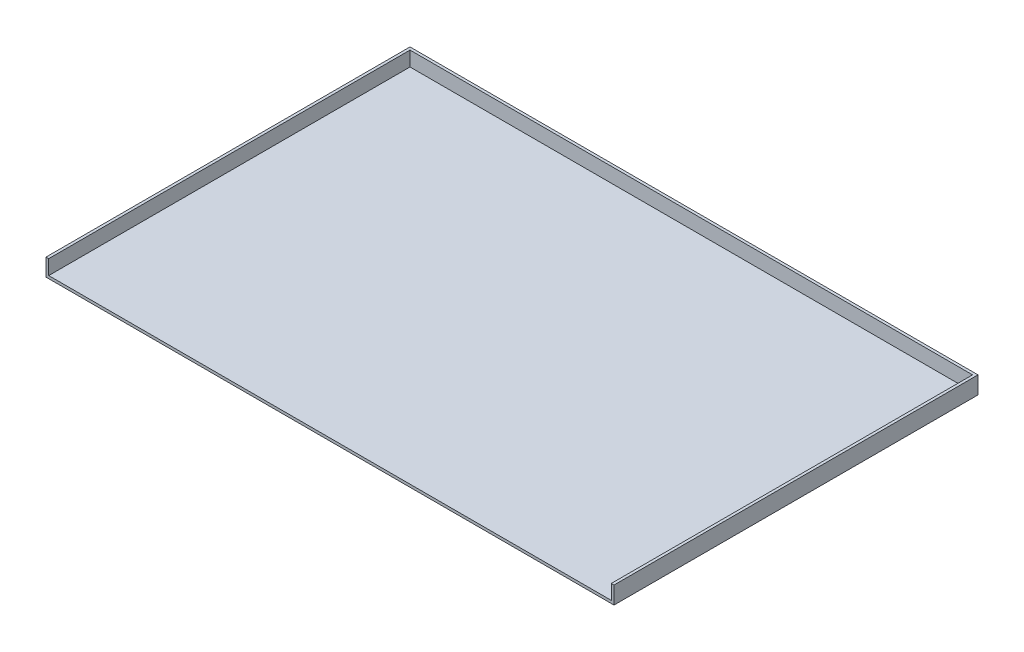
ISO-10303-21;
HEADER;
FILE_DESCRIPTION(('STEP AP214'),'2;1');
FILE_NAME('part.step','',(''),(''),'','','');
FILE_SCHEMA(('AUTOMOTIVE_DESIGN { 1 0 10303 214 1 1 1 1 }'));
ENDSEC;
DATA;
#1=APPLICATION_CONTEXT('core data for automotive mechanical design processes');
#2=APPLICATION_PROTOCOL_DEFINITION('international standard','automotive_design',2000,#1);
#3=PRODUCT_CONTEXT('',#1,'mechanical');
#4=PRODUCT('Part','Part','',(#3));
#5=PRODUCT_RELATED_PRODUCT_CATEGORY('part','',(#4));
#6=PRODUCT_DEFINITION_FORMATION('','',#4);
#7=PRODUCT_DEFINITION_CONTEXT('part definition',#1,'design');
#8=PRODUCT_DEFINITION('design','',#6,#7);
#9=PRODUCT_DEFINITION_SHAPE('','',#8);
#10=(LENGTH_UNIT() NAMED_UNIT(*) SI_UNIT(.MILLI.,.METRE.));
#11=(NAMED_UNIT(*) PLANE_ANGLE_UNIT() SI_UNIT($,.RADIAN.));
#12=(NAMED_UNIT(*) SI_UNIT($,.STERADIAN.) SOLID_ANGLE_UNIT());
#13=UNCERTAINTY_MEASURE_WITH_UNIT(LENGTH_MEASURE(1.E-05),#10,'distance_accuracy_value','');
#14=(GEOMETRIC_REPRESENTATION_CONTEXT(3) GLOBAL_UNCERTAINTY_ASSIGNED_CONTEXT((#13)) GLOBAL_UNIT_ASSIGNED_CONTEXT((#10,
#11,#12)) REPRESENTATION_CONTEXT('',''));
#15=CARTESIAN_POINT('',(0.,0.,0.));
#16=DIRECTION('',(0.,0.,1.));
#17=DIRECTION('',(1.,0.,0.));
#18=AXIS2_PLACEMENT_3D('',#15,#16,#17);
#19=CARTESIAN_POINT('',(-193.5,0.925,248.));
#20=DIRECTION('',(0.,-1.,0.));
#21=DIRECTION('',(0.,0.,-1.));
#22=AXIS2_PLACEMENT_3D('',#19,#20,#21);
#23=PLANE('',#22);
#24=DIRECTION('',(0.,0.,1.));
#25=VECTOR('',#24,1.);
#26=CARTESIAN_POINT('',(191.65,0.925,1.85000000000005));
#27=LINE('',#26,#25);
#28=CARTESIAN_POINT('',(191.65,0.925,1.85000000000005));
#29=VERTEX_POINT('',#28);
#30=CARTESIAN_POINT('',(191.65,0.925,248.));
#31=VERTEX_POINT('',#30);
#32=EDGE_CURVE('E50',#29,#31,#27,.T.);
#33=ORIENTED_EDGE('',*,*,#32,.F.);
#34=DIRECTION('',(1.,0.,0.));
#35=VECTOR('',#34,1.);
#36=CARTESIAN_POINT('',(-191.65,0.925,1.85000000000005));
#37=LINE('',#36,#35);
#38=CARTESIAN_POINT('',(-191.65,0.925,1.85000000000005));
#39=VERTEX_POINT('',#38);
#40=EDGE_CURVE('E127',#39,#29,#37,.T.);
#41=ORIENTED_EDGE('',*,*,#40,.F.);
#42=DIRECTION('',(0.,0.,-1.));
#43=VECTOR('',#42,1.);
#44=CARTESIAN_POINT('',(-191.65,0.925,248.));
#45=LINE('',#44,#43);
#46=CARTESIAN_POINT('',(-191.65,0.925,248.));
#47=VERTEX_POINT('',#46);
#48=EDGE_CURVE('E55',#47,#39,#45,.T.);
#49=ORIENTED_EDGE('',*,*,#48,.F.);
#50=DIRECTION('',(-1.,0.,0.));
#51=VECTOR('',#50,1.);
#52=CARTESIAN_POINT('',(-193.5,0.925,248.));
#53=LINE('',#52,#51);
#54=EDGE_CURVE('E110',#31,#47,#53,.T.);
#55=ORIENTED_EDGE('',*,*,#54,.F.);
#56=EDGE_LOOP('',(#33,#41,#49,#55));
#57=FACE_BOUND('',#56,.T.);
#58=ADVANCED_FACE('F35',(#57),#23,.F.);
#59=CARTESIAN_POINT('',(193.5,-0.925,248.));
#60=DIRECTION('',(-1.,0.,0.));
#61=DIRECTION('',(0.,0.,1.));
#62=AXIS2_PLACEMENT_3D('',#59,#60,#61);
#63=PLANE('',#62);
#64=DIRECTION('',(0.,1.,0.));
#65=VECTOR('',#64,1.);
#66=CARTESIAN_POINT('',(193.5,-0.925,0.));
#67=LINE('',#66,#65);
#68=CARTESIAN_POINT('',(193.5,-0.925,0.));
#69=VERTEX_POINT('',#68);
#70=CARTESIAN_POINT('',(193.5,10.925,0.));
#71=VERTEX_POINT('',#70);
#72=EDGE_CURVE('E116',#69,#71,#67,.T.);
#73=ORIENTED_EDGE('',*,*,#72,.T.);
#74=DIRECTION('',(0.,0.,-1.));
#75=VECTOR('',#74,1.);
#76=CARTESIAN_POINT('',(193.5,10.925,248.));
#77=LINE('',#76,#75);
#78=CARTESIAN_POINT('',(193.5,10.925,248.));
#79=VERTEX_POINT('',#78);
#80=EDGE_CURVE('E114',#79,#71,#77,.T.);
#81=ORIENTED_EDGE('',*,*,#80,.F.);
#82=DIRECTION('',(0.,1.,0.));
#83=VECTOR('',#82,1.);
#84=CARTESIAN_POINT('',(193.5,-0.925,248.));
#85=LINE('',#84,#83);
#86=CARTESIAN_POINT('',(193.5,-0.925,248.));
#87=VERTEX_POINT('',#86);
#88=EDGE_CURVE('E99',#87,#79,#85,.T.);
#89=ORIENTED_EDGE('',*,*,#88,.F.);
#90=DIRECTION('',(0.,0.,-1.));
#91=VECTOR('',#90,1.);
#92=CARTESIAN_POINT('',(193.5,-0.925,248.));
#93=LINE('',#92,#91);
#94=EDGE_CURVE('E43',#87,#69,#93,.T.);
#95=ORIENTED_EDGE('',*,*,#94,.T.);
#96=EDGE_LOOP('',(#73,#81,#89,#95));
#97=FACE_BOUND('',#96,.T.);
#98=ADVANCED_FACE('F37',(#97),#63,.F.);
#99=CARTESIAN_POINT('',(-193.5,-0.925,248.));
#100=DIRECTION('',(1.,0.,0.));
#101=DIRECTION('',(0.,0.,-1.));
#102=AXIS2_PLACEMENT_3D('',#99,#100,#101);
#103=PLANE('',#102);
#104=DIRECTION('',(0.,-1.,0.));
#105=VECTOR('',#104,1.);
#106=CARTESIAN_POINT('',(-193.5,-0.925,0.));
#107=LINE('',#106,#105);
#108=CARTESIAN_POINT('',(-193.5,10.925,0.));
#109=VERTEX_POINT('',#108);
#110=CARTESIAN_POINT('',(-193.5,-0.925,0.));
#111=VERTEX_POINT('',#110);
#112=EDGE_CURVE('E159',#109,#111,#107,.T.);
#113=ORIENTED_EDGE('',*,*,#112,.T.);
#114=DIRECTION('',(0.,0.,-1.));
#115=VECTOR('',#114,1.);
#116=CARTESIAN_POINT('',(-193.5,-0.925,248.));
#117=LINE('',#116,#115);
#118=CARTESIAN_POINT('',(-193.5,-0.925,248.));
#119=VERTEX_POINT('',#118);
#120=EDGE_CURVE('E11',#119,#111,#117,.T.);
#121=ORIENTED_EDGE('',*,*,#120,.F.);
#122=DIRECTION('',(0.,-1.,0.));
#123=VECTOR('',#122,1.);
#124=CARTESIAN_POINT('',(-193.5,-0.925,248.));
#125=LINE('',#124,#123);
#126=CARTESIAN_POINT('',(-193.5,10.925,248.));
#127=VERTEX_POINT('',#126);
#128=EDGE_CURVE('E155',#127,#119,#125,.T.);
#129=ORIENTED_EDGE('',*,*,#128,.F.);
#130=DIRECTION('',(0.,0.,1.));
#131=VECTOR('',#130,1.);
#132=CARTESIAN_POINT('',(-193.5,10.925,0.));
#133=LINE('',#132,#131);
#134=EDGE_CURVE('E131',#109,#127,#133,.T.);
#135=ORIENTED_EDGE('',*,*,#134,.F.);
#136=EDGE_LOOP('',(#113,#121,#129,#135));
#137=FACE_BOUND('',#136,.T.);
#138=ADVANCED_FACE('F168',(#137),#103,.F.);
#139=CARTESIAN_POINT('',(-193.5,-0.925,248.));
#140=DIRECTION('',(0.,1.,0.));
#141=DIRECTION('',(0.,0.,1.));
#142=AXIS2_PLACEMENT_3D('',#139,#140,#141);
#143=PLANE('',#142);
#144=DIRECTION('',(1.,0.,0.));
#145=VECTOR('',#144,1.);
#146=CARTESIAN_POINT('',(-193.5,-0.925,0.));
#147=LINE('',#146,#145);
#148=EDGE_CURVE('E111',#111,#69,#147,.T.);
#149=ORIENTED_EDGE('',*,*,#148,.T.);
#150=ORIENTED_EDGE('',*,*,#94,.F.);
#151=DIRECTION('',(1.,0.,0.));
#152=VECTOR('',#151,1.);
#153=CARTESIAN_POINT('',(-193.5,-0.925,248.));
#154=LINE('',#153,#152);
#155=EDGE_CURVE('E106',#119,#87,#154,.T.);
#156=ORIENTED_EDGE('',*,*,#155,.F.);
#157=ORIENTED_EDGE('',*,*,#120,.T.);
#158=EDGE_LOOP('',(#149,#150,#156,#157));
#159=FACE_BOUND('',#158,.T.);
#160=ADVANCED_FACE('F188',(#159),#143,.F.);
#161=CARTESIAN_POINT('',(0.,0.,248.));
#162=DIRECTION('',(0.,0.,-1.));
#163=DIRECTION('',(-1.,0.,0.));
#164=AXIS2_PLACEMENT_3D('',#161,#162,#163);
#165=PLANE('',#164);
#166=ORIENTED_EDGE('',*,*,#88,.T.);
#167=DIRECTION('',(1.,0.,0.));
#168=VECTOR('',#167,1.);
#169=CARTESIAN_POINT('',(191.65,10.925,248.));
#170=LINE('',#169,#168);
#171=CARTESIAN_POINT('',(191.65,10.925,248.));
#172=VERTEX_POINT('',#171);
#173=EDGE_CURVE('E104',#172,#79,#170,.T.);
#174=ORIENTED_EDGE('',*,*,#173,.F.);
#175=DIRECTION('',(0.,-1.,0.));
#176=VECTOR('',#175,1.);
#177=CARTESIAN_POINT('',(191.65,10.925,248.));
#178=LINE('',#177,#176);
#179=EDGE_CURVE('E141',#172,#31,#178,.T.);
#180=ORIENTED_EDGE('',*,*,#179,.T.);
#181=ORIENTED_EDGE('',*,*,#54,.T.);
#182=DIRECTION('',(0.,-1.,0.));
#183=VECTOR('',#182,1.);
#184=CARTESIAN_POINT('',(-191.65,10.925,248.));
#185=LINE('',#184,#183);
#186=CARTESIAN_POINT('',(-191.65,10.925,248.));
#187=VERTEX_POINT('',#186);
#188=EDGE_CURVE('E151',#187,#47,#185,.T.);
#189=ORIENTED_EDGE('',*,*,#188,.F.);
#190=DIRECTION('',(1.,0.,0.));
#191=VECTOR('',#190,1.);
#192=CARTESIAN_POINT('',(-193.5,10.925,248.));
#193=LINE('',#192,#191);
#194=EDGE_CURVE('E134',#127,#187,#193,.T.);
#195=ORIENTED_EDGE('',*,*,#194,.F.);
#196=ORIENTED_EDGE('',*,*,#128,.T.);
#197=ORIENTED_EDGE('',*,*,#155,.T.);
#198=EDGE_LOOP('',(#166,#174,#180,#181,#189,#195,#196,#197));
#199=FACE_BOUND('',#198,.T.);
#200=ADVANCED_FACE('F101',(#199),#165,.F.);
#201=CARTESIAN_POINT('',(0.,0.,0.));
#202=DIRECTION('',(0.,0.,-1.));
#203=DIRECTION('',(-1.,0.,0.));
#204=AXIS2_PLACEMENT_3D('',#201,#202,#203);
#205=PLANE('',#204);
#206=ORIENTED_EDGE('',*,*,#72,.F.);
#207=ORIENTED_EDGE('',*,*,#148,.F.);
#208=ORIENTED_EDGE('',*,*,#112,.F.);
#209=DIRECTION('',(-1.,0.,0.));
#210=VECTOR('',#209,1.);
#211=CARTESIAN_POINT('',(193.5,10.925,0.));
#212=LINE('',#211,#210);
#213=EDGE_CURVE('E120',#71,#109,#212,.T.);
#214=ORIENTED_EDGE('',*,*,#213,.F.);
#215=EDGE_LOOP('',(#206,#207,#208,#214));
#216=FACE_BOUND('',#215,.T.);
#217=ADVANCED_FACE('F164',(#216),#205,.T.);
#218=CARTESIAN_POINT('',(-191.65,10.925,248.));
#219=DIRECTION('',(-1.,0.,0.));
#220=DIRECTION('',(0.,0.,1.));
#221=AXIS2_PLACEMENT_3D('',#218,#219,#220);
#222=PLANE('',#221);
#223=ORIENTED_EDGE('',*,*,#48,.T.);
#224=DIRECTION('',(0.,-1.,0.));
#225=VECTOR('',#224,1.);
#226=CARTESIAN_POINT('',(-191.65,10.925,1.85000000000005));
#227=LINE('',#226,#225);
#228=CARTESIAN_POINT('',(-191.65,10.925,1.85000000000005));
#229=VERTEX_POINT('',#228);
#230=EDGE_CURVE('E148',#229,#39,#227,.T.);
#231=ORIENTED_EDGE('',*,*,#230,.F.);
#232=DIRECTION('',(0.,0.,-1.));
#233=VECTOR('',#232,1.);
#234=CARTESIAN_POINT('',(-191.65,10.925,248.));
#235=LINE('',#234,#233);
#236=EDGE_CURVE('E136',#187,#229,#235,.T.);
#237=ORIENTED_EDGE('',*,*,#236,.F.);
#238=ORIENTED_EDGE('',*,*,#188,.T.);
#239=EDGE_LOOP('',(#223,#231,#237,#238));
#240=FACE_BOUND('',#239,.T.);
#241=ADVANCED_FACE('F176',(#240),#222,.F.);
#242=CARTESIAN_POINT('',(-191.65,10.925,1.85000000000005));
#243=DIRECTION('',(0.,0.,-1.));
#244=DIRECTION('',(-1.,0.,0.));
#245=AXIS2_PLACEMENT_3D('',#242,#243,#244);
#246=PLANE('',#245);
#247=ORIENTED_EDGE('',*,*,#40,.T.);
#248=DIRECTION('',(0.,-1.,0.));
#249=VECTOR('',#248,1.);
#250=CARTESIAN_POINT('',(191.65,10.925,1.85000000000005));
#251=LINE('',#250,#249);
#252=CARTESIAN_POINT('',(191.65,10.925,1.85000000000005));
#253=VERTEX_POINT('',#252);
#254=EDGE_CURVE('E145',#253,#29,#251,.T.);
#255=ORIENTED_EDGE('',*,*,#254,.F.);
#256=DIRECTION('',(1.,0.,0.));
#257=VECTOR('',#256,1.);
#258=CARTESIAN_POINT('',(-191.65,10.925,1.85000000000005));
#259=LINE('',#258,#257);
#260=EDGE_CURVE('E138',#229,#253,#259,.T.);
#261=ORIENTED_EDGE('',*,*,#260,.F.);
#262=ORIENTED_EDGE('',*,*,#230,.T.);
#263=EDGE_LOOP('',(#247,#255,#261,#262));
#264=FACE_BOUND('',#263,.T.);
#265=ADVANCED_FACE('F178',(#264),#246,.F.);
#266=CARTESIAN_POINT('',(191.65,10.925,1.85000000000005));
#267=DIRECTION('',(1.,0.,0.));
#268=DIRECTION('',(0.,0.,-1.));
#269=AXIS2_PLACEMENT_3D('',#266,#267,#268);
#270=PLANE('',#269);
#271=ORIENTED_EDGE('',*,*,#32,.T.);
#272=ORIENTED_EDGE('',*,*,#179,.F.);
#273=DIRECTION('',(0.,0.,1.));
#274=VECTOR('',#273,1.);
#275=CARTESIAN_POINT('',(191.65,10.925,1.85000000000005));
#276=LINE('',#275,#274);
#277=EDGE_CURVE('E124',#253,#172,#276,.T.);
#278=ORIENTED_EDGE('',*,*,#277,.F.);
#279=ORIENTED_EDGE('',*,*,#254,.T.);
#280=EDGE_LOOP('',(#271,#272,#278,#279));
#281=FACE_BOUND('',#280,.T.);
#282=ADVANCED_FACE('F180',(#281),#270,.F.);
#283=CARTESIAN_POINT('',(0.,10.925,0.));
#284=DIRECTION('',(0.,1.,0.));
#285=DIRECTION('',(0.,0.,1.));
#286=AXIS2_PLACEMENT_3D('',#283,#284,#285);
#287=PLANE('',#286);
#288=ORIENTED_EDGE('',*,*,#173,.T.);
#289=ORIENTED_EDGE('',*,*,#80,.T.);
#290=ORIENTED_EDGE('',*,*,#213,.T.);
#291=ORIENTED_EDGE('',*,*,#134,.T.);
#292=ORIENTED_EDGE('',*,*,#194,.T.);
#293=ORIENTED_EDGE('',*,*,#236,.T.);
#294=ORIENTED_EDGE('',*,*,#260,.T.);
#295=ORIENTED_EDGE('',*,*,#277,.T.);
#296=EDGE_LOOP('',(#288,#289,#290,#291,#292,#293,#294,#295));
#297=FACE_BOUND('',#296,.T.);
#298=ADVANCED_FACE('F122',(#297),#287,.T.);
#299=CLOSED_SHELL('',(#58,#98,#138,#160,#200,#217,#241,#265,#282,#298));
#300=MANIFOLD_SOLID_BREP('B2',#299);
#301=ADVANCED_BREP_SHAPE_REPRESENTATION('',(#18,#300),#14);
#302=SHAPE_DEFINITION_REPRESENTATION(#9,#301);
ENDSEC;
END-ISO-10303-21;
